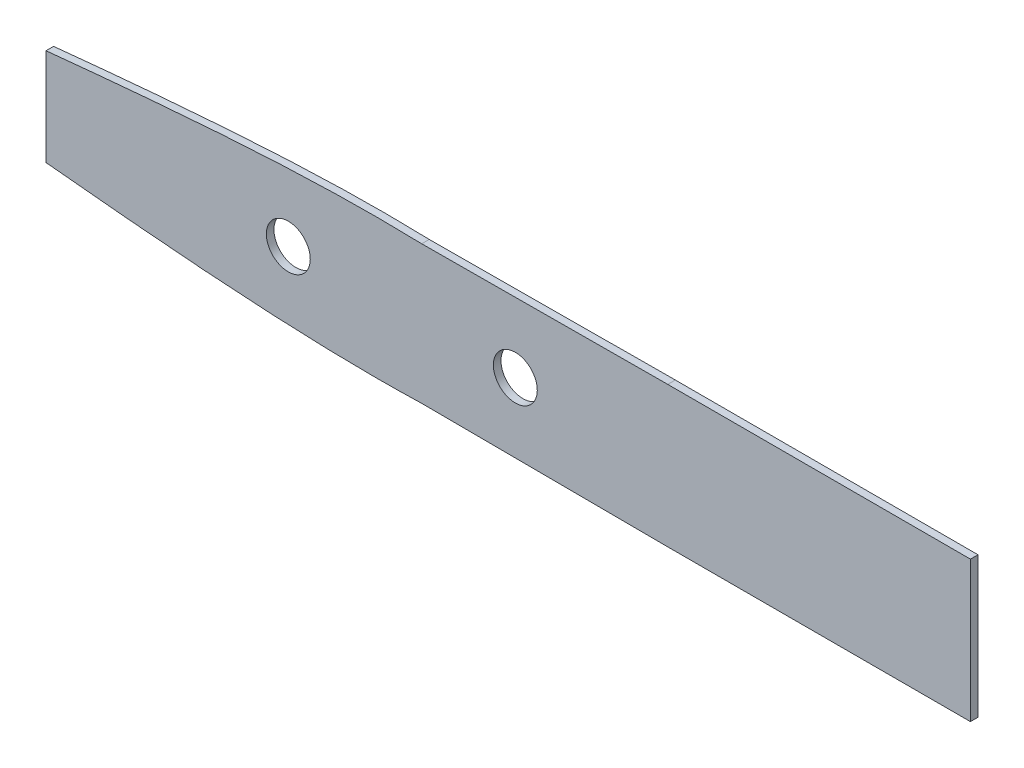
ISO-10303-21;
HEADER;
FILE_DESCRIPTION(('STEP AP214'),'2;1');
FILE_NAME('part.step','',(''),(''),'','','');
FILE_SCHEMA(('AUTOMOTIVE_DESIGN { 1 0 10303 214 1 1 1 1 }'));
ENDSEC;
DATA;
#1=APPLICATION_CONTEXT('core data for automotive mechanical design processes');
#2=APPLICATION_PROTOCOL_DEFINITION('international standard','automotive_design',2000,#1);
#3=PRODUCT_CONTEXT('',#1,'mechanical');
#4=PRODUCT('Part','Part','',(#3));
#5=PRODUCT_RELATED_PRODUCT_CATEGORY('part','',(#4));
#6=PRODUCT_DEFINITION_FORMATION('','',#4);
#7=PRODUCT_DEFINITION_CONTEXT('part definition',#1,'design');
#8=PRODUCT_DEFINITION('design','',#6,#7);
#9=PRODUCT_DEFINITION_SHAPE('','',#8);
#10=(LENGTH_UNIT() NAMED_UNIT(*) SI_UNIT(.MILLI.,.METRE.));
#11=(NAMED_UNIT(*) PLANE_ANGLE_UNIT() SI_UNIT($,.RADIAN.));
#12=(NAMED_UNIT(*) SI_UNIT($,.STERADIAN.) SOLID_ANGLE_UNIT());
#13=UNCERTAINTY_MEASURE_WITH_UNIT(LENGTH_MEASURE(1.E-05),#10,'distance_accuracy_value','');
#14=(GEOMETRIC_REPRESENTATION_CONTEXT(3) GLOBAL_UNCERTAINTY_ASSIGNED_CONTEXT((#13)) GLOBAL_UNIT_ASSIGNED_CONTEXT((#10,
#11,#12)) REPRESENTATION_CONTEXT('',''));
#15=CARTESIAN_POINT('',(0.,0.,0.));
#16=DIRECTION('',(0.,0.,1.));
#17=DIRECTION('',(1.,0.,0.));
#18=AXIS2_PLACEMENT_3D('',#15,#16,#17);
#19=CARTESIAN_POINT('',(-67.928698338171,0.,1.27));
#20=DIRECTION('',(1.,0.,0.));
#21=DIRECTION('',(0.,0.,-1.));
#22=AXIS2_PLACEMENT_3D('',#19,#20,#21);
#23=PLANE('',#22);
#24=DIRECTION('',(0.,-1.,0.));
#25=VECTOR('',#24,1.);
#26=CARTESIAN_POINT('',(-67.928698338171,0.,0.));
#27=LINE('',#26,#25);
#28=CARTESIAN_POINT('',(-67.928698338171,11.165767896904,0.));
#29=VERTEX_POINT('',#28);
#30=CARTESIAN_POINT('',(-67.928698338171,-5.09495887007872,0.));
#31=VERTEX_POINT('',#30);
#32=EDGE_CURVE('E204',#29,#31,#27,.T.);
#33=ORIENTED_EDGE('',*,*,#32,.T.);
#34=DIRECTION('',(0.,0.,-1.));
#35=VECTOR('',#34,1.);
#36=CARTESIAN_POINT('',(-67.928698338171,-5.09495887007872,1.27));
#37=LINE('',#36,#35);
#38=CARTESIAN_POINT('',(-67.928698338171,-5.09495887007872,1.27));
#39=VERTEX_POINT('',#38);
#40=EDGE_CURVE('E11',#39,#31,#37,.T.);
#41=ORIENTED_EDGE('',*,*,#40,.F.);
#42=DIRECTION('',(0.,-1.,0.));
#43=VECTOR('',#42,1.);
#44=CARTESIAN_POINT('',(-67.928698338171,0.,1.27));
#45=LINE('',#44,#43);
#46=CARTESIAN_POINT('',(-67.928698338171,11.165767896904,1.27));
#47=VERTEX_POINT('',#46);
#48=EDGE_CURVE('E175',#47,#39,#45,.T.);
#49=ORIENTED_EDGE('',*,*,#48,.F.);
#50=DIRECTION('',(0.,0.,-1.));
#51=VECTOR('',#50,1.);
#52=CARTESIAN_POINT('',(-67.928698338171,11.165767896904,1.27));
#53=LINE('',#52,#51);
#54=EDGE_CURVE('E135',#47,#29,#53,.T.);
#55=ORIENTED_EDGE('',*,*,#54,.T.);
#56=EDGE_LOOP('',(#33,#41,#49,#55));
#57=FACE_BOUND('',#56,.T.);
#58=ADVANCED_FACE('F34',(#57),#23,.F.);
#59=CARTESIAN_POINT('',(-67.928698338171,-5.09495887007872,1.27));
#60=CARTESIAN_POINT('',(-65.3171508914032,-5.35727138791386,1.27));
#61=CARTESIAN_POINT('',(-59.4450475588151,-5.93539968982965,1.27));
#62=CARTESIAN_POINT('',(-50.370544125945,-6.76380795591778,1.27));
#63=CARTESIAN_POINT('',(-40.7998819397665,-7.53268647291752,1.27));
#64=CARTESIAN_POINT('',(-31.5062890854801,-8.13769904826798,1.27));
#65=CARTESIAN_POINT('',(-22.5753113716585,-8.54113531458791,1.27));
#66=CARTESIAN_POINT('',(-14.0814865661878,-8.71253478185414,1.27));
#67=CARTESIAN_POINT('',(-8.23045529271849,-8.6603536224397,1.27));
#68=CARTESIAN_POINT('',(-5.21948525647767,-8.57103800328929,1.27));
#69=CARTESIAN_POINT('',(-4.87655585992879,-8.56002155286711,1.27));
#70=B_SPLINE_CURVE_WITH_KNOTS('',3,(#59,#60,#61,#62,#63,#64,#65,#66,#67,#68,#69),.UNSPECIFIED.,
.F.,.F.,(4,1,1,1,1,1,1,1,4),(0.615514614556933,0.636045709827617,0.661669948561994,
0.686792378284257,0.711149583737943,0.734517597060195,0.756718609739707,0.777596498807337,
0.780280213240994),.UNSPECIFIED.);
#71=DIRECTION('',(0.,0.,-1.));
#72=VECTOR('',#71,1.);
#73=SURFACE_OF_LINEAR_EXTRUSION('',#70,#72);
#74=CARTESIAN_POINT('',(-67.928698338171,-5.09495887007872,0.));
#75=CARTESIAN_POINT('',(-65.3171508914032,-5.35727138791386,0.));
#76=CARTESIAN_POINT('',(-59.4450475588151,-5.93539968982965,0.));
#77=CARTESIAN_POINT('',(-50.370544125945,-6.76380795591778,0.));
#78=CARTESIAN_POINT('',(-40.7998819397665,-7.53268647291752,0.));
#79=CARTESIAN_POINT('',(-31.5062890854801,-8.13769904826798,0.));
#80=CARTESIAN_POINT('',(-22.5753113716585,-8.54113531458791,0.));
#81=CARTESIAN_POINT('',(-14.0814865661878,-8.71253478185414,0.));
#82=CARTESIAN_POINT('',(-8.23045529271849,-8.6603536224397,0.));
#83=CARTESIAN_POINT('',(-5.21948525647767,-8.57103800328929,0.));
#84=CARTESIAN_POINT('',(-4.87655585992879,-8.56002155286711,0.));
#85=B_SPLINE_CURVE_WITH_KNOTS('',3,(#74,#75,#76,#77,#78,#79,#80,#81,#82,#83,#84),.UNSPECIFIED.,
.F.,.F.,(4,1,1,1,1,1,1,1,4),(0.615514614556933,0.636045709827617,0.661669948561994,
0.686792378284257,0.711149583737943,0.734517597060195,0.756718609739707,0.777596498807337,
0.780280213240994),.UNSPECIFIED.);
#86=CARTESIAN_POINT('',(-4.87655585992879,-8.56002155286711,0.));
#87=VERTEX_POINT('',#86);
#88=EDGE_CURVE('E200',#31,#87,#85,.T.);
#89=ORIENTED_EDGE('',*,*,#88,.T.);
#90=DIRECTION('',(0.,0.,-1.));
#91=VECTOR('',#90,1.);
#92=CARTESIAN_POINT('',(-4.87655585992879,-8.56002155286711,1.27));
#93=LINE('',#92,#91);
#94=CARTESIAN_POINT('',(-4.87655585992879,-8.56002155286711,1.27));
#95=VERTEX_POINT('',#94);
#96=EDGE_CURVE('E43',#95,#87,#93,.T.);
#97=ORIENTED_EDGE('',*,*,#96,.F.);
#98=EDGE_CURVE('E93',#39,#95,#70,.T.);
#99=ORIENTED_EDGE('',*,*,#98,.F.);
#100=ORIENTED_EDGE('',*,*,#40,.T.);
#101=EDGE_LOOP('',(#89,#97,#99,#100));
#102=FACE_BOUND('',#101,.T.);
#103=ADVANCED_FACE('F164',(#102),#73,.F.);
#104=CARTESIAN_POINT('',(-0.0448221874993361,-8.58524725298161,1.27));
#105=DIRECTION('',(0.00522076712859503,0.999986371702429,0.));
#106=DIRECTION('',(-0.999986371702429,0.00522076712859503,0.));
#107=AXIS2_PLACEMENT_3D('',#104,#105,#106);
#108=PLANE('',#107);
#109=DIRECTION('',(0.999986371702429,-0.00522076712859503,0.));
#110=VECTOR('',#109,1.);
#111=CARTESIAN_POINT('',(-0.0448221874993361,-8.58524725298161,0.));
#112=LINE('',#111,#110);
#113=CARTESIAN_POINT('',(36.414501661829,-8.77559548658735,0.));
#114=VERTEX_POINT('',#113);
#115=EDGE_CURVE('E196',#87,#114,#112,.T.);
#116=ORIENTED_EDGE('',*,*,#115,.T.);
#117=DIRECTION('',(0.,0.,-1.));
#118=VECTOR('',#117,1.);
#119=CARTESIAN_POINT('',(36.414501661829,-8.77559548658735,1.27));
#120=LINE('',#119,#118);
#121=CARTESIAN_POINT('',(36.414501661829,-8.77559548658735,1.27));
#122=VERTEX_POINT('',#121);
#123=EDGE_CURVE('E183',#122,#114,#120,.T.);
#124=ORIENTED_EDGE('',*,*,#123,.F.);
#125=DIRECTION('',(0.999986371702429,-0.00522076712859503,0.));
#126=VECTOR('',#125,1.);
#127=CARTESIAN_POINT('',(-0.0448221874993361,-8.58524725298161,1.27));
#128=LINE('',#127,#126);
#129=EDGE_CURVE('E174',#95,#122,#128,.T.);
#130=ORIENTED_EDGE('',*,*,#129,.F.);
#131=ORIENTED_EDGE('',*,*,#96,.T.);
#132=EDGE_LOOP('',(#116,#124,#130,#131));
#133=FACE_BOUND('',#132,.T.);
#134=ADVANCED_FACE('F160',(#133),#108,.F.);
#135=CARTESIAN_POINT('',(0.,-8.77559548658734,1.27));
#136=DIRECTION('',(0.,-1.,0.));
#137=DIRECTION('',(1.,0.,0.));
#138=AXIS2_PLACEMENT_3D('',#135,#136,#137);
#139=PLANE('',#138);
#140=DIRECTION('',(-1.,0.,0.));
#141=VECTOR('',#140,1.);
#142=CARTESIAN_POINT('',(0.,-8.77559548658734,0.));
#143=LINE('',#142,#141);
#144=CARTESIAN_POINT('',(87.214501661829,-8.77559548658736,0.));
#145=VERTEX_POINT('',#144);
#146=EDGE_CURVE('E201',#145,#114,#143,.T.);
#147=ORIENTED_EDGE('',*,*,#146,.F.);
#148=DIRECTION('',(0.,0.,-1.));
#149=VECTOR('',#148,1.);
#150=CARTESIAN_POINT('',(87.214501661829,-8.77559548658736,1.27));
#151=LINE('',#150,#149);
#152=CARTESIAN_POINT('',(87.214501661829,-8.77559548658736,1.27));
#153=VERTEX_POINT('',#152);
#154=EDGE_CURVE('E185',#153,#145,#151,.T.);
#155=ORIENTED_EDGE('',*,*,#154,.F.);
#156=DIRECTION('',(-1.,0.,0.));
#157=VECTOR('',#156,1.);
#158=CARTESIAN_POINT('',(0.,-8.77559548658734,1.27));
#159=LINE('',#158,#157);
#160=EDGE_CURVE('E127',#153,#122,#159,.T.);
#161=ORIENTED_EDGE('',*,*,#160,.T.);
#162=ORIENTED_EDGE('',*,*,#123,.T.);
#163=EDGE_LOOP('',(#147,#155,#161,#162));
#164=FACE_BOUND('',#163,.T.);
#165=ADVANCED_FACE('F156',(#164),#139,.T.);
#166=CARTESIAN_POINT('',(87.214501661829,0.,1.27));
#167=DIRECTION('',(1.,0.,0.));
#168=DIRECTION('',(0.,0.,-1.));
#169=AXIS2_PLACEMENT_3D('',#166,#167,#168);
#170=PLANE('',#169);
#171=DIRECTION('',(0.,-1.,0.));
#172=VECTOR('',#171,1.);
#173=CARTESIAN_POINT('',(87.214501661829,0.,0.));
#174=LINE('',#173,#172);
#175=CARTESIAN_POINT('',(87.214501661829,14.8464045134127,0.));
#176=VERTEX_POINT('',#175);
#177=EDGE_CURVE('E189',#176,#145,#174,.T.);
#178=ORIENTED_EDGE('',*,*,#177,.F.);
#179=DIRECTION('',(0.,0.,-1.));
#180=VECTOR('',#179,1.);
#181=CARTESIAN_POINT('',(87.214501661829,14.8464045134127,1.27));
#182=LINE('',#181,#180);
#183=CARTESIAN_POINT('',(87.214501661829,14.8464045134127,1.27));
#184=VERTEX_POINT('',#183);
#185=EDGE_CURVE('E115',#184,#176,#182,.T.);
#186=ORIENTED_EDGE('',*,*,#185,.F.);
#187=DIRECTION('',(0.,-1.,0.));
#188=VECTOR('',#187,1.);
#189=CARTESIAN_POINT('',(87.214501661829,0.,1.27));
#190=LINE('',#189,#188);
#191=EDGE_CURVE('E125',#184,#153,#190,.T.);
#192=ORIENTED_EDGE('',*,*,#191,.T.);
#193=ORIENTED_EDGE('',*,*,#154,.T.);
#194=EDGE_LOOP('',(#178,#186,#192,#193));
#195=FACE_BOUND('',#194,.T.);
#196=ADVANCED_FACE('F153',(#195),#170,.T.);
#197=CARTESIAN_POINT('',(0.,14.8464045134126,1.27));
#198=DIRECTION('',(0.,1.,0.));
#199=DIRECTION('',(-1.,0.,0.));
#200=AXIS2_PLACEMENT_3D('',#197,#198,#199);
#201=PLANE('',#200);
#202=DIRECTION('',(1.,0.,0.));
#203=VECTOR('',#202,1.);
#204=CARTESIAN_POINT('',(0.,14.8464045134126,0.));
#205=LINE('',#204,#203);
#206=CARTESIAN_POINT('',(36.414501661829,14.8464045134126,0.));
#207=VERTEX_POINT('',#206);
#208=EDGE_CURVE('E114',#207,#176,#205,.T.);
#209=ORIENTED_EDGE('',*,*,#208,.F.);
#210=DIRECTION('',(0.,0.,-1.));
#211=VECTOR('',#210,1.);
#212=CARTESIAN_POINT('',(36.414501661829,14.8464045134126,1.27));
#213=LINE('',#212,#211);
#214=CARTESIAN_POINT('',(36.414501661829,14.8464045134126,1.27));
#215=VERTEX_POINT('',#214);
#216=EDGE_CURVE('E108',#215,#207,#213,.T.);
#217=ORIENTED_EDGE('',*,*,#216,.F.);
#218=DIRECTION('',(1.,0.,0.));
#219=VECTOR('',#218,1.);
#220=CARTESIAN_POINT('',(0.,14.8464045134126,1.27));
#221=LINE('',#220,#219);
#222=EDGE_CURVE('E112',#215,#184,#221,.T.);
#223=ORIENTED_EDGE('',*,*,#222,.T.);
#224=ORIENTED_EDGE('',*,*,#185,.T.);
#225=EDGE_LOOP('',(#209,#217,#223,#224));
#226=FACE_BOUND('',#225,.T.);
#227=ADVANCED_FACE('F110',(#226),#201,.T.);
#228=CARTESIAN_POINT('',(-0.0765160357713409,14.655890811351,1.27));
#229=DIRECTION('',(0.0052207671285853,-0.999986371702429,0.));
#230=DIRECTION('',(0.999986371702429,0.0052207671285853,0.));
#231=AXIS2_PLACEMENT_3D('',#228,#229,#230);
#232=PLANE('',#231);
#233=DIRECTION('',(-0.999986371702429,-0.0052207671285853,0.));
#234=VECTOR('',#233,1.);
#235=CARTESIAN_POINT('',(-0.0765160357713409,14.655890811351,0.));
#236=LINE('',#235,#234);
#237=CARTESIAN_POINT('',(-4.8765558599376,14.6308305796928,0.));
#238=VERTEX_POINT('',#237);
#239=EDGE_CURVE('E79',#207,#238,#236,.T.);
#240=ORIENTED_EDGE('',*,*,#239,.T.);
#241=DIRECTION('',(0.,0.,-1.));
#242=VECTOR('',#241,1.);
#243=CARTESIAN_POINT('',(-4.8765558599376,14.6308305796928,1.27));
#244=LINE('',#243,#242);
#245=CARTESIAN_POINT('',(-4.8765558599376,14.6308305796928,1.27));
#246=VERTEX_POINT('',#245);
#247=EDGE_CURVE('E116',#246,#238,#244,.T.);
#248=ORIENTED_EDGE('',*,*,#247,.F.);
#249=DIRECTION('',(-0.999986371702429,-0.0052207671285853,0.));
#250=VECTOR('',#249,1.);
#251=CARTESIAN_POINT('',(-0.0765160357713409,14.655890811351,1.27));
#252=LINE('',#251,#250);
#253=EDGE_CURVE('E118',#215,#246,#252,.T.);
#254=ORIENTED_EDGE('',*,*,#253,.F.);
#255=ORIENTED_EDGE('',*,*,#216,.T.);
#256=EDGE_LOOP('',(#240,#248,#254,#255));
#257=FACE_BOUND('',#256,.T.);
#258=ADVANCED_FACE('F119',(#257),#232,.F.);
#259=CARTESIAN_POINT('',(10.836701661829,3.03540451341265,1.27));
#260=DIRECTION('',(0.,0.,-1.));
#261=DIRECTION('',(-1.,0.,0.));
#262=AXIS2_PLACEMENT_3D('',#259,#260,#261);
#263=CYLINDRICAL_SURFACE('',#262,3.683);
#264=CARTESIAN_POINT('',(10.836701661829,3.03540451341265,1.27));
#265=DIRECTION('',(0.,0.,1.));
#266=DIRECTION('',(1.,0.,0.));
#267=AXIS2_PLACEMENT_3D('',#264,#265,#266);
#268=CIRCLE('',#267,3.683);
#269=CARTESIAN_POINT('',(14.519701661829,3.03540451341265,1.27));
#270=VERTEX_POINT('',#269);
#271=EDGE_CURVE('E314',#270,#270,#268,.T.);
#272=ORIENTED_EDGE('',*,*,#271,.T.);
#273=EDGE_LOOP('',(#272));
#274=FACE_BOUND('',#273,.T.);
#275=CARTESIAN_POINT('',(10.836701661829,3.03540451341265,0.));
#276=DIRECTION('',(0.,0.,1.));
#277=DIRECTION('',(1.,0.,0.));
#278=AXIS2_PLACEMENT_3D('',#275,#276,#277);
#279=CIRCLE('',#278,3.683);
#280=CARTESIAN_POINT('',(14.519701661829,3.03540451341265,0.));
#281=VERTEX_POINT('',#280);
#282=EDGE_CURVE('E223',#281,#281,#279,.T.);
#283=ORIENTED_EDGE('',*,*,#282,.F.);
#284=EDGE_LOOP('',(#283));
#285=FACE_BOUND('',#284,.T.);
#286=ADVANCED_FACE('F150',(#274,#285),#263,.F.);
#287=CARTESIAN_POINT('',(-27.263298338171,3.03540451341265,1.27));
#288=DIRECTION('',(0.,0.,-1.));
#289=DIRECTION('',(-1.,0.,0.));
#290=AXIS2_PLACEMENT_3D('',#287,#288,#289);
#291=CYLINDRICAL_SURFACE('',#290,3.683);
#292=CARTESIAN_POINT('',(-27.263298338171,3.03540451341265,1.27));
#293=DIRECTION('',(0.,0.,1.));
#294=DIRECTION('',(1.,0.,0.));
#295=AXIS2_PLACEMENT_3D('',#292,#293,#294);
#296=CIRCLE('',#295,3.683);
#297=CARTESIAN_POINT('',(-23.580298338171,3.03540451341265,1.27));
#298=VERTEX_POINT('',#297);
#299=EDGE_CURVE('E216',#298,#298,#296,.T.);
#300=ORIENTED_EDGE('',*,*,#299,.T.);
#301=EDGE_LOOP('',(#300));
#302=FACE_BOUND('',#301,.T.);
#303=CARTESIAN_POINT('',(-27.263298338171,3.03540451341265,0.));
#304=DIRECTION('',(0.,0.,1.));
#305=DIRECTION('',(1.,0.,0.));
#306=AXIS2_PLACEMENT_3D('',#303,#304,#305);
#307=CIRCLE('',#306,3.683);
#308=CARTESIAN_POINT('',(-23.580298338171,3.03540451341265,0.));
#309=VERTEX_POINT('',#308);
#310=EDGE_CURVE('E136',#309,#309,#307,.T.);
#311=ORIENTED_EDGE('',*,*,#310,.F.);
#312=EDGE_LOOP('',(#311));
#313=FACE_BOUND('',#312,.T.);
#314=ADVANCED_FACE('F36',(#302,#313),#291,.F.);
#315=CARTESIAN_POINT('',(-4.87655585993759,14.6308305796928,1.27));
#316=CARTESIAN_POINT('',(-5.21948525648353,14.6418470301148,1.27));
#317=CARTESIAN_POINT('',(-8.2304552927214,14.7311626492651,1.27));
#318=CARTESIAN_POINT('',(-14.0814865661878,14.7833438086795,1.27));
#319=CARTESIAN_POINT('',(-22.5753113716586,14.6119443414133,1.27));
#320=CARTESIAN_POINT('',(-31.5062890854801,14.2085080750933,1.27));
#321=CARTESIAN_POINT('',(-40.7998819397664,13.6034954997429,1.27));
#322=CARTESIAN_POINT('',(-50.3705441259451,12.8346169827431,1.27));
#323=CARTESIAN_POINT('',(-59.4450475588151,12.006208716655,1.27));
#324=CARTESIAN_POINT('',(-65.3171508914032,11.4280804147392,1.27));
#325=CARTESIAN_POINT('',(-67.928698338171,11.165767896904,1.27));
#326=B_SPLINE_CURVE_WITH_KNOTS('',3,(#315,#316,#317,#318,#319,#320,#321,#322,#323,#324,#325),
.UNSPECIFIED.,.F.,.F.,(4,1,1,1,1,1,1,1,4),(0.219719786759006,0.22240350119264,0.24328139026027,
0.265482402939782,0.288850416262034,0.31320762171572,0.338330051437983,0.363954290172359,
0.384485385443044),.UNSPECIFIED.);
#327=DIRECTION('',(0.,0.,-1.));
#328=VECTOR('',#327,1.);
#329=SURFACE_OF_LINEAR_EXTRUSION('',#326,#328);
#330=CARTESIAN_POINT('',(-4.87655585993759,14.6308305796928,0.));
#331=CARTESIAN_POINT('',(-5.21948525648353,14.6418470301148,0.));
#332=CARTESIAN_POINT('',(-8.2304552927214,14.7311626492651,0.));
#333=CARTESIAN_POINT('',(-14.0814865661878,14.7833438086795,0.));
#334=CARTESIAN_POINT('',(-22.5753113716586,14.6119443414133,0.));
#335=CARTESIAN_POINT('',(-31.5062890854801,14.2085080750933,0.));
#336=CARTESIAN_POINT('',(-40.7998819397664,13.6034954997429,0.));
#337=CARTESIAN_POINT('',(-50.3705441259451,12.8346169827431,0.));
#338=CARTESIAN_POINT('',(-59.4450475588151,12.006208716655,0.));
#339=CARTESIAN_POINT('',(-65.3171508914032,11.4280804147392,0.));
#340=CARTESIAN_POINT('',(-67.928698338171,11.165767896904,0.));
#341=B_SPLINE_CURVE_WITH_KNOTS('',3,(#330,#331,#332,#333,#334,#335,#336,#337,#338,#339,#340),
.UNSPECIFIED.,.F.,.F.,(4,1,1,1,1,1,1,1,4),(0.219719786759006,0.22240350119264,0.24328139026027,
0.265482402939782,0.288850416262034,0.31320762171572,0.338330051437983,0.363954290172359,
0.384485385443044),.UNSPECIFIED.);
#342=EDGE_CURVE('E85',#238,#29,#341,.T.);
#343=ORIENTED_EDGE('',*,*,#342,.T.);
#344=ORIENTED_EDGE('',*,*,#54,.F.);
#345=EDGE_CURVE('E51',#246,#47,#326,.T.);
#346=ORIENTED_EDGE('',*,*,#345,.F.);
#347=ORIENTED_EDGE('',*,*,#247,.T.);
#348=EDGE_LOOP('',(#343,#344,#346,#347));
#349=FACE_BOUND('',#348,.T.);
#350=ADVANCED_FACE('F142',(#349),#329,.F.);
#351=CARTESIAN_POINT('',(0.,0.,1.27));
#352=DIRECTION('',(0.,0.,1.));
#353=DIRECTION('',(1.,0.,0.));
#354=AXIS2_PLACEMENT_3D('',#351,#352,#353);
#355=PLANE('',#354);
#356=ORIENTED_EDGE('',*,*,#299,.F.);
#357=EDGE_LOOP('',(#356));
#358=FACE_BOUND('',#357,.T.);
#359=ORIENTED_EDGE('',*,*,#271,.F.);
#360=EDGE_LOOP('',(#359));
#361=FACE_BOUND('',#360,.T.);
#362=ORIENTED_EDGE('',*,*,#48,.T.);
#363=ORIENTED_EDGE('',*,*,#98,.T.);
#364=ORIENTED_EDGE('',*,*,#129,.T.);
#365=ORIENTED_EDGE('',*,*,#160,.F.);
#366=ORIENTED_EDGE('',*,*,#191,.F.);
#367=ORIENTED_EDGE('',*,*,#222,.F.);
#368=ORIENTED_EDGE('',*,*,#253,.T.);
#369=ORIENTED_EDGE('',*,*,#345,.T.);
#370=EDGE_LOOP('',(#362,#363,#364,#365,#366,#367,#368,#369));
#371=FACE_BOUND('',#370,.T.);
#372=ADVANCED_FACE('F122',(#358,#361,#371),#355,.T.);
#373=CARTESIAN_POINT('',(0.,0.,0.));
#374=DIRECTION('',(0.,0.,1.));
#375=DIRECTION('',(1.,0.,0.));
#376=AXIS2_PLACEMENT_3D('',#373,#374,#375);
#377=PLANE('',#376);
#378=ORIENTED_EDGE('',*,*,#310,.T.);
#379=EDGE_LOOP('',(#378));
#380=FACE_BOUND('',#379,.T.);
#381=ORIENTED_EDGE('',*,*,#282,.T.);
#382=EDGE_LOOP('',(#381));
#383=FACE_BOUND('',#382,.T.);
#384=ORIENTED_EDGE('',*,*,#32,.F.);
#385=ORIENTED_EDGE('',*,*,#342,.F.);
#386=ORIENTED_EDGE('',*,*,#239,.F.);
#387=ORIENTED_EDGE('',*,*,#208,.T.);
#388=ORIENTED_EDGE('',*,*,#177,.T.);
#389=ORIENTED_EDGE('',*,*,#146,.T.);
#390=ORIENTED_EDGE('',*,*,#115,.F.);
#391=ORIENTED_EDGE('',*,*,#88,.F.);
#392=EDGE_LOOP('',(#384,#385,#386,#387,#388,#389,#390,#391));
#393=FACE_BOUND('',#392,.T.);
#394=ADVANCED_FACE('F146',(#380,#383,#393),#377,.F.);
#395=CLOSED_SHELL('',(#58,#103,#134,#165,#196,#227,#258,#286,#314,#350,#372,#394));
#396=MANIFOLD_SOLID_BREP('B2',#395);
#397=ADVANCED_BREP_SHAPE_REPRESENTATION('',(#18,#396),#14);
#398=SHAPE_DEFINITION_REPRESENTATION(#9,#397);
ENDSEC;
END-ISO-10303-21;
